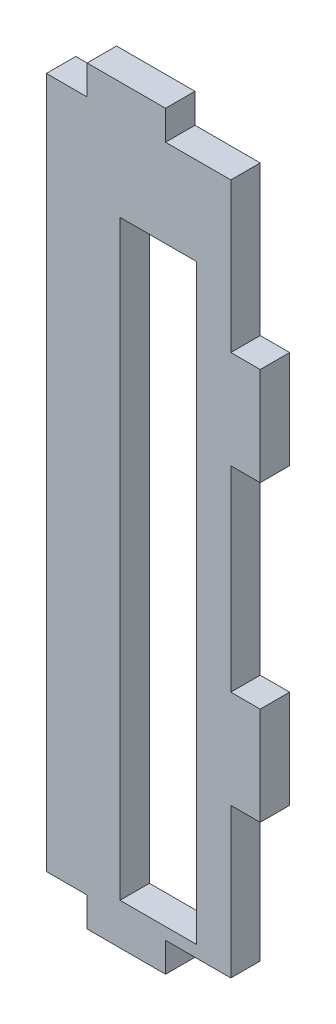
ISO-10303-21;
HEADER;
FILE_DESCRIPTION(('STEP AP214'),'2;1');
FILE_NAME('part.step','',(''),(''),'','','');
FILE_SCHEMA(('AUTOMOTIVE_DESIGN { 1 0 10303 214 1 1 1 1 }'));
ENDSEC;
DATA;
#1=APPLICATION_CONTEXT('core data for automotive mechanical design processes');
#2=APPLICATION_PROTOCOL_DEFINITION('international standard','automotive_design',2000,#1);
#3=PRODUCT_CONTEXT('',#1,'mechanical');
#4=PRODUCT('Part','Part','',(#3));
#5=PRODUCT_RELATED_PRODUCT_CATEGORY('part','',(#4));
#6=PRODUCT_DEFINITION_FORMATION('','',#4);
#7=PRODUCT_DEFINITION_CONTEXT('part definition',#1,'design');
#8=PRODUCT_DEFINITION('design','',#6,#7);
#9=PRODUCT_DEFINITION_SHAPE('','',#8);
#10=(LENGTH_UNIT() NAMED_UNIT(*) SI_UNIT(.MILLI.,.METRE.));
#11=(NAMED_UNIT(*) PLANE_ANGLE_UNIT() SI_UNIT($,.RADIAN.));
#12=(NAMED_UNIT(*) SI_UNIT($,.STERADIAN.) SOLID_ANGLE_UNIT());
#13=UNCERTAINTY_MEASURE_WITH_UNIT(LENGTH_MEASURE(1.E-05),#10,'distance_accuracy_value','');
#14=(GEOMETRIC_REPRESENTATION_CONTEXT(3) GLOBAL_UNCERTAINTY_ASSIGNED_CONTEXT((#13)) GLOBAL_UNIT_ASSIGNED_CONTEXT((#10,
#11,#12)) REPRESENTATION_CONTEXT('',''));
#15=CARTESIAN_POINT('',(0.,0.,0.));
#16=DIRECTION('',(0.,0.,1.));
#17=DIRECTION('',(1.,0.,0.));
#18=AXIS2_PLACEMENT_3D('',#15,#16,#17);
#19=CARTESIAN_POINT('',(0.,44.5,3.));
#20=DIRECTION('',(0.,-1.,0.));
#21=DIRECTION('',(0.,0.,-1.));
#22=AXIS2_PLACEMENT_3D('',#19,#20,#21);
#23=PLANE('',#22);
#24=DIRECTION('',(0.,0.,1.));
#25=VECTOR('',#24,1.);
#26=CARTESIAN_POINT('',(-14.6559207945465,44.4999999999989,0.));
#27=LINE('',#26,#25);
#28=CARTESIAN_POINT('',(-14.6559207945465,44.4999999999989,0.));
#29=VERTEX_POINT('',#28);
#30=CARTESIAN_POINT('',(-14.6559207945465,44.4999999999989,3.));
#31=VERTEX_POINT('',#30);
#32=EDGE_CURVE('E226',#29,#31,#27,.T.);
#33=ORIENTED_EDGE('',*,*,#32,.F.);
#34=DIRECTION('',(-1.,0.,0.));
#35=VECTOR('',#34,1.);
#36=CARTESIAN_POINT('',(0.,44.5,0.));
#37=LINE('',#36,#35);
#38=CARTESIAN_POINT('',(-18.811841589093,44.5,0.));
#39=VERTEX_POINT('',#38);
#40=EDGE_CURVE('E341',#29,#39,#37,.T.);
#41=ORIENTED_EDGE('',*,*,#40,.T.);
#42=DIRECTION('',(0.,0.,1.));
#43=VECTOR('',#42,1.);
#44=CARTESIAN_POINT('',(-18.811841589093,44.5,0.));
#45=LINE('',#44,#43);
#46=CARTESIAN_POINT('',(-18.811841589093,44.5,3.));
#47=VERTEX_POINT('',#46);
#48=EDGE_CURVE('E259',#39,#47,#45,.T.);
#49=ORIENTED_EDGE('',*,*,#48,.T.);
#50=DIRECTION('',(-1.,0.,0.));
#51=VECTOR('',#50,1.);
#52=CARTESIAN_POINT('',(0.,44.5,3.));
#53=LINE('',#52,#51);
#54=EDGE_CURVE('E313',#31,#47,#53,.T.);
#55=ORIENTED_EDGE('',*,*,#54,.F.);
#56=EDGE_LOOP('',(#33,#41,#49,#55));
#57=FACE_BOUND('',#56,.T.);
#58=ADVANCED_FACE('F33',(#57),#23,.F.);
#59=CARTESIAN_POINT('',(0.,-26.,3.));
#60=DIRECTION('',(0.,1.,0.));
#61=DIRECTION('',(0.,0.,1.));
#62=AXIS2_PLACEMENT_3D('',#59,#60,#61);
#63=PLANE('',#62);
#64=DIRECTION('',(0.,0.,1.));
#65=VECTOR('',#64,1.);
#66=CARTESIAN_POINT('',(-6.65592079454651,-25.9999999999989,0.));
#67=LINE('',#66,#65);
#68=CARTESIAN_POINT('',(-6.65592079454651,-25.9999999999989,0.));
#69=VERTEX_POINT('',#68);
#70=CARTESIAN_POINT('',(-6.65592079454651,-25.9999999999989,3.));
#71=VERTEX_POINT('',#70);
#72=EDGE_CURVE('E245',#69,#71,#67,.T.);
#73=ORIENTED_EDGE('',*,*,#72,.F.);
#74=DIRECTION('',(1.,0.,0.));
#75=VECTOR('',#74,1.);
#76=CARTESIAN_POINT('',(0.,-26.,0.));
#77=LINE('',#76,#75);
#78=CARTESIAN_POINT('',(0.,-26.,0.));
#79=VERTEX_POINT('',#78);
#80=EDGE_CURVE('E344',#69,#79,#77,.T.);
#81=ORIENTED_EDGE('',*,*,#80,.T.);
#82=DIRECTION('',(0.,0.,-1.));
#83=VECTOR('',#82,1.);
#84=CARTESIAN_POINT('',(0.,-26.,3.));
#85=LINE('',#84,#83);
#86=CARTESIAN_POINT('',(0.,-26.,3.));
#87=VERTEX_POINT('',#86);
#88=EDGE_CURVE('E351',#87,#79,#85,.T.);
#89=ORIENTED_EDGE('',*,*,#88,.F.);
#90=DIRECTION('',(1.,0.,0.));
#91=VECTOR('',#90,1.);
#92=CARTESIAN_POINT('',(-19.311841589093,-26.,3.));
#93=LINE('',#92,#91);
#94=EDGE_CURVE('E317',#71,#87,#93,.T.);
#95=ORIENTED_EDGE('',*,*,#94,.F.);
#96=EDGE_LOOP('',(#73,#81,#89,#95));
#97=FACE_BOUND('',#96,.T.);
#98=ADVANCED_FACE('F412',(#97),#63,.F.);
#99=CARTESIAN_POINT('',(0.,0.,3.));
#100=DIRECTION('',(0.,0.,1.));
#101=DIRECTION('',(1.,0.,0.));
#102=AXIS2_PLACEMENT_3D('',#99,#100,#101);
#103=PLANE('',#102);
#104=DIRECTION('',(0.,1.,0.));
#105=VECTOR('',#104,1.);
#106=CARTESIAN_POINT('',(-18.811841589093,-26.,3.));
#107=LINE('',#106,#105);
#108=CARTESIAN_POINT('',(-18.811841589093,-26.,3.));
#109=VERTEX_POINT('',#108);
#110=EDGE_CURVE('E247',#109,#47,#107,.T.);
#111=ORIENTED_EDGE('',*,*,#110,.F.);
#112=CARTESIAN_POINT('',(-14.6559207945465,-26.,3.));
#113=VERTEX_POINT('',#112);
#114=EDGE_CURVE('E318',#109,#113,#93,.T.);
#115=ORIENTED_EDGE('',*,*,#114,.T.);
#116=DIRECTION('',(0.,-1.,0.));
#117=VECTOR('',#116,1.);
#118=CARTESIAN_POINT('',(-14.6559207945465,-25.9999999999989,3.));
#119=LINE('',#118,#117);
#120=CARTESIAN_POINT('',(-14.6559207945465,-28.9999999999989,3.));
#121=VERTEX_POINT('',#120);
#122=EDGE_CURVE('E56',#113,#121,#119,.T.);
#123=ORIENTED_EDGE('',*,*,#122,.T.);
#124=DIRECTION('',(1.,0.,0.));
#125=VECTOR('',#124,1.);
#126=CARTESIAN_POINT('',(-6.65592079454651,-28.9999999999989,3.));
#127=LINE('',#126,#125);
#128=CARTESIAN_POINT('',(-6.65592079454651,-28.9999999999989,3.));
#129=VERTEX_POINT('',#128);
#130=EDGE_CURVE('E240',#121,#129,#127,.T.);
#131=ORIENTED_EDGE('',*,*,#130,.T.);
#132=DIRECTION('',(0.,1.,0.));
#133=VECTOR('',#132,1.);
#134=CARTESIAN_POINT('',(-6.65592079454651,-25.9999999999989,3.));
#135=LINE('',#134,#133);
#136=EDGE_CURVE('E233',#129,#71,#135,.T.);
#137=ORIENTED_EDGE('',*,*,#136,.T.);
#138=ORIENTED_EDGE('',*,*,#94,.T.);
#139=DIRECTION('',(0.,1.,0.));
#140=VECTOR('',#139,1.);
#141=CARTESIAN_POINT('',(0.,-24.,3.));
#142=LINE('',#141,#140);
#143=CARTESIAN_POINT('',(0.,-10.75,3.));
#144=VERTEX_POINT('',#143);
#145=EDGE_CURVE('E321',#87,#144,#142,.T.);
#146=ORIENTED_EDGE('',*,*,#145,.T.);
#147=DIRECTION('',(1.,0.,0.));
#148=VECTOR('',#147,1.);
#149=CARTESIAN_POINT('',(3.,-10.75,3.));
#150=LINE('',#149,#148);
#151=CARTESIAN_POINT('',(3.,-10.75,3.));
#152=VERTEX_POINT('',#151);
#153=EDGE_CURVE('E295',#144,#152,#150,.T.);
#154=ORIENTED_EDGE('',*,*,#153,.T.);
#155=DIRECTION('',(0.,1.,0.));
#156=VECTOR('',#155,1.);
#157=CARTESIAN_POINT('',(3.,-10.75,3.));
#158=LINE('',#157,#156);
#159=CARTESIAN_POINT('',(3.,-0.750000000000018,3.));
#160=VERTEX_POINT('',#159);
#161=EDGE_CURVE('E298',#152,#160,#158,.T.);
#162=ORIENTED_EDGE('',*,*,#161,.T.);
#163=DIRECTION('',(-1.,0.,0.));
#164=VECTOR('',#163,1.);
#165=CARTESIAN_POINT('',(3.,-0.750000000000018,3.));
#166=LINE('',#165,#164);
#167=CARTESIAN_POINT('',(0.,-0.750000000000015,3.));
#168=VERTEX_POINT('',#167);
#169=EDGE_CURVE('E301',#160,#168,#166,.T.);
#170=ORIENTED_EDGE('',*,*,#169,.T.);
#171=DIRECTION('',(0.,1.,0.));
#172=VECTOR('',#171,1.);
#173=CARTESIAN_POINT('',(0.,19.25,3.));
#174=LINE('',#173,#172);
#175=CARTESIAN_POINT('',(0.,19.25,3.));
#176=VERTEX_POINT('',#175);
#177=EDGE_CURVE('E303',#168,#176,#174,.T.);
#178=ORIENTED_EDGE('',*,*,#177,.T.);
#179=DIRECTION('',(1.,0.,0.));
#180=VECTOR('',#179,1.);
#181=CARTESIAN_POINT('',(3.,19.25,3.));
#182=LINE('',#181,#180);
#183=CARTESIAN_POINT('',(3.,19.25,3.));
#184=VERTEX_POINT('',#183);
#185=EDGE_CURVE('E305',#176,#184,#182,.T.);
#186=ORIENTED_EDGE('',*,*,#185,.T.);
#187=DIRECTION('',(0.,1.,0.));
#188=VECTOR('',#187,1.);
#189=CARTESIAN_POINT('',(3.,19.25,3.));
#190=LINE('',#189,#188);
#191=CARTESIAN_POINT('',(3.,29.25,3.));
#192=VERTEX_POINT('',#191);
#193=EDGE_CURVE('E307',#184,#192,#190,.T.);
#194=ORIENTED_EDGE('',*,*,#193,.T.);
#195=DIRECTION('',(-1.,0.,0.));
#196=VECTOR('',#195,1.);
#197=CARTESIAN_POINT('',(3.,29.25,3.));
#198=LINE('',#197,#196);
#199=CARTESIAN_POINT('',(0.,29.25,3.));
#200=VERTEX_POINT('',#199);
#201=EDGE_CURVE('E309',#192,#200,#198,.T.);
#202=ORIENTED_EDGE('',*,*,#201,.T.);
#203=DIRECTION('',(0.,1.,0.));
#204=VECTOR('',#203,1.);
#205=CARTESIAN_POINT('',(0.,42.4999999999999,3.));
#206=LINE('',#205,#204);
#207=CARTESIAN_POINT('',(0.,44.5,3.));
#208=VERTEX_POINT('',#207);
#209=EDGE_CURVE('E311',#200,#208,#206,.T.);
#210=ORIENTED_EDGE('',*,*,#209,.T.);
#211=CARTESIAN_POINT('',(-6.65592079454651,44.5,3.));
#212=VERTEX_POINT('',#211);
#213=EDGE_CURVE('E314',#208,#212,#53,.T.);
#214=ORIENTED_EDGE('',*,*,#213,.T.);
#215=DIRECTION('',(0.,1.,0.));
#216=VECTOR('',#215,1.);
#217=CARTESIAN_POINT('',(-6.65592079454651,44.4999999999989,3.));
#218=LINE('',#217,#216);
#219=CARTESIAN_POINT('',(-6.65592079454651,47.4999999999989,3.));
#220=VERTEX_POINT('',#219);
#221=EDGE_CURVE('E48',#212,#220,#218,.T.);
#222=ORIENTED_EDGE('',*,*,#221,.T.);
#223=DIRECTION('',(-1.,0.,0.));
#224=VECTOR('',#223,1.);
#225=CARTESIAN_POINT('',(-6.65592079454651,47.4999999999989,3.));
#226=LINE('',#225,#224);
#227=CARTESIAN_POINT('',(-14.6559207945465,47.4999999999989,3.));
#228=VERTEX_POINT('',#227);
#229=EDGE_CURVE('E199',#220,#228,#226,.T.);
#230=ORIENTED_EDGE('',*,*,#229,.T.);
#231=DIRECTION('',(0.,-1.,0.));
#232=VECTOR('',#231,1.);
#233=CARTESIAN_POINT('',(-14.6559207945465,44.4999999999989,3.));
#234=LINE('',#233,#232);
#235=EDGE_CURVE('E217',#228,#31,#234,.T.);
#236=ORIENTED_EDGE('',*,*,#235,.T.);
#237=ORIENTED_EDGE('',*,*,#54,.T.);
#238=EDGE_LOOP('',(#111,#115,#123,#131,#137,#138,#146,#154,#162,#170,#178,#186,#194,#202,#210,
#214,#222,#230,#236,#237));
#239=FACE_BOUND('',#238,.T.);
#240=DIRECTION('',(0.,1.,0.));
#241=VECTOR('',#240,1.);
#242=CARTESIAN_POINT('',(-3.49999999999997,-24.785,3.));
#243=LINE('',#242,#241);
#244=CARTESIAN_POINT('',(-3.49999999999997,-24.785,3.));
#245=VERTEX_POINT('',#244);
#246=CARTESIAN_POINT('',(-3.49999999999997,35.54,3.));
#247=VERTEX_POINT('',#246);
#248=EDGE_CURVE('E266',#245,#247,#243,.T.);
#249=ORIENTED_EDGE('',*,*,#248,.F.);
#250=DIRECTION('',(1.,0.,0.));
#251=VECTOR('',#250,1.);
#252=CARTESIAN_POINT('',(-3.49999999999997,-24.785,3.));
#253=LINE('',#252,#251);
#254=CARTESIAN_POINT('',(-11.3,-24.785,3.));
#255=VERTEX_POINT('',#254);
#256=EDGE_CURVE('E264',#255,#245,#253,.T.);
#257=ORIENTED_EDGE('',*,*,#256,.F.);
#258=DIRECTION('',(0.,-1.,0.));
#259=VECTOR('',#258,1.);
#260=CARTESIAN_POINT('',(-11.3,-24.785,3.));
#261=LINE('',#260,#259);
#262=CARTESIAN_POINT('',(-11.3,35.54,3.));
#263=VERTEX_POINT('',#262);
#264=EDGE_CURVE('E272',#263,#255,#261,.T.);
#265=ORIENTED_EDGE('',*,*,#264,.F.);
#266=DIRECTION('',(-1.,0.,0.));
#267=VECTOR('',#266,1.);
#268=CARTESIAN_POINT('',(-3.49999999999997,35.54,3.));
#269=LINE('',#268,#267);
#270=EDGE_CURVE('E269',#247,#263,#269,.T.);
#271=ORIENTED_EDGE('',*,*,#270,.F.);
#272=EDGE_LOOP('',(#249,#257,#265,#271));
#273=FACE_BOUND('',#272,.T.);
#274=ADVANCED_FACE('F394',(#239,#273),#103,.T.);
#275=CARTESIAN_POINT('',(0.,0.,0.));
#276=DIRECTION('',(0.,0.,1.));
#277=DIRECTION('',(1.,0.,0.));
#278=AXIS2_PLACEMENT_3D('',#275,#276,#277);
#279=PLANE('',#278);
#280=CARTESIAN_POINT('',(-18.811841589093,-26.,0.));
#281=VERTEX_POINT('',#280);
#282=CARTESIAN_POINT('',(-14.6559207945465,-25.9999999999989,0.));
#283=VERTEX_POINT('',#282);
#284=EDGE_CURVE('E345',#281,#283,#77,.T.);
#285=ORIENTED_EDGE('',*,*,#284,.F.);
#286=DIRECTION('',(0.,1.,0.));
#287=VECTOR('',#286,1.);
#288=CARTESIAN_POINT('',(-18.811841589093,-26.,0.));
#289=LINE('',#288,#287);
#290=EDGE_CURVE('E253',#281,#39,#289,.T.);
#291=ORIENTED_EDGE('',*,*,#290,.T.);
#292=ORIENTED_EDGE('',*,*,#40,.F.);
#293=DIRECTION('',(0.,-1.,0.));
#294=VECTOR('',#293,1.);
#295=CARTESIAN_POINT('',(-14.6559207945465,44.4999999999989,0.));
#296=LINE('',#295,#294);
#297=CARTESIAN_POINT('',(-14.6559207945465,47.4999999999989,0.));
#298=VERTEX_POINT('',#297);
#299=EDGE_CURVE('E202',#298,#29,#296,.T.);
#300=ORIENTED_EDGE('',*,*,#299,.F.);
#301=DIRECTION('',(-1.,0.,0.));
#302=VECTOR('',#301,1.);
#303=CARTESIAN_POINT('',(-6.65592079454651,47.4999999999989,0.));
#304=LINE('',#303,#302);
#305=CARTESIAN_POINT('',(-6.65592079454651,47.4999999999989,0.));
#306=VERTEX_POINT('',#305);
#307=EDGE_CURVE('E197',#306,#298,#304,.T.);
#308=ORIENTED_EDGE('',*,*,#307,.F.);
#309=DIRECTION('',(0.,1.,0.));
#310=VECTOR('',#309,1.);
#311=CARTESIAN_POINT('',(-6.65592079454651,44.4999999999989,0.));
#312=LINE('',#311,#310);
#313=CARTESIAN_POINT('',(-6.65592079454651,44.4999999999989,0.));
#314=VERTEX_POINT('',#313);
#315=EDGE_CURVE('E211',#314,#306,#312,.T.);
#316=ORIENTED_EDGE('',*,*,#315,.F.);
#317=CARTESIAN_POINT('',(0.,44.5,0.));
#318=VERTEX_POINT('',#317);
#319=EDGE_CURVE('E342',#318,#314,#37,.T.);
#320=ORIENTED_EDGE('',*,*,#319,.F.);
#321=DIRECTION('',(0.,1.,0.));
#322=VECTOR('',#321,1.);
#323=CARTESIAN_POINT('',(0.,44.5,0.));
#324=LINE('',#323,#322);
#325=CARTESIAN_POINT('',(0.,29.25,0.));
#326=VERTEX_POINT('',#325);
#327=EDGE_CURVE('E339',#326,#318,#324,.T.);
#328=ORIENTED_EDGE('',*,*,#327,.F.);
#329=DIRECTION('',(-1.,0.,0.));
#330=VECTOR('',#329,1.);
#331=CARTESIAN_POINT('',(3.,29.25,0.));
#332=LINE('',#331,#330);
#333=CARTESIAN_POINT('',(3.,29.25,0.));
#334=VERTEX_POINT('',#333);
#335=EDGE_CURVE('E336',#334,#326,#332,.T.);
#336=ORIENTED_EDGE('',*,*,#335,.F.);
#337=DIRECTION('',(0.,1.,0.));
#338=VECTOR('',#337,1.);
#339=CARTESIAN_POINT('',(3.,19.25,0.));
#340=LINE('',#339,#338);
#341=CARTESIAN_POINT('',(3.,19.25,0.));
#342=VERTEX_POINT('',#341);
#343=EDGE_CURVE('E334',#342,#334,#340,.T.);
#344=ORIENTED_EDGE('',*,*,#343,.F.);
#345=DIRECTION('',(1.,0.,0.));
#346=VECTOR('',#345,1.);
#347=CARTESIAN_POINT('',(3.,19.25,0.));
#348=LINE('',#347,#346);
#349=CARTESIAN_POINT('',(0.,19.25,0.));
#350=VERTEX_POINT('',#349);
#351=EDGE_CURVE('E332',#350,#342,#348,.T.);
#352=ORIENTED_EDGE('',*,*,#351,.F.);
#353=DIRECTION('',(0.,1.,0.));
#354=VECTOR('',#353,1.);
#355=CARTESIAN_POINT('',(0.,19.25,0.));
#356=LINE('',#355,#354);
#357=CARTESIAN_POINT('',(0.,-0.750000000000015,0.));
#358=VERTEX_POINT('',#357);
#359=EDGE_CURVE('E330',#358,#350,#356,.T.);
#360=ORIENTED_EDGE('',*,*,#359,.F.);
#361=DIRECTION('',(-1.,0.,0.));
#362=VECTOR('',#361,1.);
#363=CARTESIAN_POINT('',(3.,-0.750000000000018,0.));
#364=LINE('',#363,#362);
#365=CARTESIAN_POINT('',(3.,-0.750000000000018,0.));
#366=VERTEX_POINT('',#365);
#367=EDGE_CURVE('E328',#366,#358,#364,.T.);
#368=ORIENTED_EDGE('',*,*,#367,.F.);
#369=DIRECTION('',(0.,1.,0.));
#370=VECTOR('',#369,1.);
#371=CARTESIAN_POINT('',(3.,-10.75,0.));
#372=LINE('',#371,#370);
#373=CARTESIAN_POINT('',(3.,-10.75,0.));
#374=VERTEX_POINT('',#373);
#375=EDGE_CURVE('E326',#374,#366,#372,.T.);
#376=ORIENTED_EDGE('',*,*,#375,.F.);
#377=DIRECTION('',(1.,0.,0.));
#378=VECTOR('',#377,1.);
#379=CARTESIAN_POINT('',(3.,-10.75,0.));
#380=LINE('',#379,#378);
#381=CARTESIAN_POINT('',(0.,-10.75,0.));
#382=VERTEX_POINT('',#381);
#383=EDGE_CURVE('E294',#382,#374,#380,.T.);
#384=ORIENTED_EDGE('',*,*,#383,.F.);
#385=DIRECTION('',(0.,1.,0.));
#386=VECTOR('',#385,1.);
#387=CARTESIAN_POINT('',(0.,-10.75,0.));
#388=LINE('',#387,#386);
#389=EDGE_CURVE('E299',#79,#382,#388,.T.);
#390=ORIENTED_EDGE('',*,*,#389,.F.);
#391=ORIENTED_EDGE('',*,*,#80,.F.);
#392=DIRECTION('',(0.,1.,0.));
#393=VECTOR('',#392,1.);
#394=CARTESIAN_POINT('',(-6.65592079454651,-25.9999999999989,0.));
#395=LINE('',#394,#393);
#396=CARTESIAN_POINT('',(-6.65592079454651,-28.9999999999989,0.));
#397=VERTEX_POINT('',#396);
#398=EDGE_CURVE('E236',#397,#69,#395,.T.);
#399=ORIENTED_EDGE('',*,*,#398,.F.);
#400=DIRECTION('',(1.,0.,0.));
#401=VECTOR('',#400,1.);
#402=CARTESIAN_POINT('',(-6.65592079454651,-28.9999999999989,0.));
#403=LINE('',#402,#401);
#404=CARTESIAN_POINT('',(-14.6559207945465,-28.9999999999989,0.));
#405=VERTEX_POINT('',#404);
#406=EDGE_CURVE('E232',#405,#397,#403,.T.);
#407=ORIENTED_EDGE('',*,*,#406,.F.);
#408=DIRECTION('',(0.,-1.,0.));
#409=VECTOR('',#408,1.);
#410=CARTESIAN_POINT('',(-14.6559207945465,-25.9999999999989,0.));
#411=LINE('',#410,#409);
#412=EDGE_CURVE('E229',#283,#405,#411,.T.);
#413=ORIENTED_EDGE('',*,*,#412,.F.);
#414=EDGE_LOOP('',(#285,#291,#292,#300,#308,#316,#320,#328,#336,#344,#352,#360,#368,#376,#384,
#390,#391,#399,#407,#413));
#415=FACE_BOUND('',#414,.T.);
#416=DIRECTION('',(1.,0.,0.));
#417=VECTOR('',#416,1.);
#418=CARTESIAN_POINT('',(-3.49999999999997,-24.785,0.));
#419=LINE('',#418,#417);
#420=CARTESIAN_POINT('',(-11.3,-24.785,0.));
#421=VERTEX_POINT('',#420);
#422=CARTESIAN_POINT('',(-3.49999999999997,-24.785,0.));
#423=VERTEX_POINT('',#422);
#424=EDGE_CURVE('E262',#421,#423,#419,.T.);
#425=ORIENTED_EDGE('',*,*,#424,.T.);
#426=DIRECTION('',(0.,1.,0.));
#427=VECTOR('',#426,1.);
#428=CARTESIAN_POINT('',(-3.49999999999997,-24.785,0.));
#429=LINE('',#428,#427);
#430=CARTESIAN_POINT('',(-3.49999999999997,35.54,0.));
#431=VERTEX_POINT('',#430);
#432=EDGE_CURVE('E277',#423,#431,#429,.T.);
#433=ORIENTED_EDGE('',*,*,#432,.T.);
#434=DIRECTION('',(-1.,0.,0.));
#435=VECTOR('',#434,1.);
#436=CARTESIAN_POINT('',(-3.49999999999997,35.54,0.));
#437=LINE('',#436,#435);
#438=CARTESIAN_POINT('',(-11.3,35.54,0.));
#439=VERTEX_POINT('',#438);
#440=EDGE_CURVE('E280',#431,#439,#437,.T.);
#441=ORIENTED_EDGE('',*,*,#440,.T.);
#442=DIRECTION('',(0.,-1.,0.));
#443=VECTOR('',#442,1.);
#444=CARTESIAN_POINT('',(-11.3,-24.785,0.));
#445=LINE('',#444,#443);
#446=EDGE_CURVE('E267',#439,#421,#445,.T.);
#447=ORIENTED_EDGE('',*,*,#446,.T.);
#448=EDGE_LOOP('',(#425,#433,#441,#447));
#449=FACE_BOUND('',#448,.T.);
#450=ADVANCED_FACE('F208',(#415,#449),#279,.F.);
#451=CARTESIAN_POINT('',(3.,-10.75,3.));
#452=DIRECTION('',(0.,1.,0.));
#453=DIRECTION('',(0.,0.,1.));
#454=AXIS2_PLACEMENT_3D('',#451,#452,#453);
#455=PLANE('',#454);
#456=ORIENTED_EDGE('',*,*,#383,.T.);
#457=DIRECTION('',(0.,0.,-1.));
#458=VECTOR('',#457,1.);
#459=CARTESIAN_POINT('',(3.,-10.75,3.));
#460=LINE('',#459,#458);
#461=EDGE_CURVE('E11',#152,#374,#460,.T.);
#462=ORIENTED_EDGE('',*,*,#461,.F.);
#463=ORIENTED_EDGE('',*,*,#153,.F.);
#464=DIRECTION('',(0.,0.,-1.));
#465=VECTOR('',#464,1.);
#466=CARTESIAN_POINT('',(0.,-10.75,3.));
#467=LINE('',#466,#465);
#468=EDGE_CURVE('E323',#144,#382,#467,.T.);
#469=ORIENTED_EDGE('',*,*,#468,.T.);
#470=EDGE_LOOP('',(#456,#462,#463,#469));
#471=FACE_BOUND('',#470,.T.);
#472=ADVANCED_FACE('F35',(#471),#455,.F.);
#473=CARTESIAN_POINT('',(3.,-10.75,3.));
#474=DIRECTION('',(-1.,0.,0.));
#475=DIRECTION('',(0.,0.,1.));
#476=AXIS2_PLACEMENT_3D('',#473,#474,#475);
#477=PLANE('',#476);
#478=ORIENTED_EDGE('',*,*,#375,.T.);
#479=DIRECTION('',(0.,0.,-1.));
#480=VECTOR('',#479,1.);
#481=CARTESIAN_POINT('',(3.,-0.750000000000018,3.));
#482=LINE('',#481,#480);
#483=EDGE_CURVE('E41',#160,#366,#482,.T.);
#484=ORIENTED_EDGE('',*,*,#483,.F.);
#485=ORIENTED_EDGE('',*,*,#161,.F.);
#486=ORIENTED_EDGE('',*,*,#461,.T.);
#487=EDGE_LOOP('',(#478,#484,#485,#486));
#488=FACE_BOUND('',#487,.T.);
#489=ADVANCED_FACE('F399',(#488),#477,.F.);
#490=CARTESIAN_POINT('',(3.,-0.750000000000018,3.));
#491=DIRECTION('',(0.,-1.,0.));
#492=DIRECTION('',(1.,0.,0.));
#493=AXIS2_PLACEMENT_3D('',#490,#491,#492);
#494=PLANE('',#493);
#495=ORIENTED_EDGE('',*,*,#367,.T.);
#496=DIRECTION('',(0.,0.,-1.));
#497=VECTOR('',#496,1.);
#498=CARTESIAN_POINT('',(0.,-0.750000000000015,3.));
#499=LINE('',#498,#497);
#500=EDGE_CURVE('E369',#168,#358,#499,.T.);
#501=ORIENTED_EDGE('',*,*,#500,.F.);
#502=ORIENTED_EDGE('',*,*,#169,.F.);
#503=ORIENTED_EDGE('',*,*,#483,.T.);
#504=EDGE_LOOP('',(#495,#501,#502,#503));
#505=FACE_BOUND('',#504,.T.);
#506=ADVANCED_FACE('F376',(#505),#494,.F.);
#507=CARTESIAN_POINT('',(0.,19.25,3.));
#508=DIRECTION('',(-1.,0.,0.));
#509=DIRECTION('',(0.,0.,1.));
#510=AXIS2_PLACEMENT_3D('',#507,#508,#509);
#511=PLANE('',#510);
#512=ORIENTED_EDGE('',*,*,#359,.T.);
#513=DIRECTION('',(0.,0.,-1.));
#514=VECTOR('',#513,1.);
#515=CARTESIAN_POINT('',(0.,19.25,3.));
#516=LINE('',#515,#514);
#517=EDGE_CURVE('E366',#176,#350,#516,.T.);
#518=ORIENTED_EDGE('',*,*,#517,.F.);
#519=ORIENTED_EDGE('',*,*,#177,.F.);
#520=ORIENTED_EDGE('',*,*,#500,.T.);
#521=EDGE_LOOP('',(#512,#518,#519,#520));
#522=FACE_BOUND('',#521,.T.);
#523=ADVANCED_FACE('F385',(#522),#511,.F.);
#524=CARTESIAN_POINT('',(3.,19.25,3.));
#525=DIRECTION('',(0.,1.,0.));
#526=DIRECTION('',(0.,0.,1.));
#527=AXIS2_PLACEMENT_3D('',#524,#525,#526);
#528=PLANE('',#527);
#529=ORIENTED_EDGE('',*,*,#351,.T.);
#530=DIRECTION('',(0.,0.,-1.));
#531=VECTOR('',#530,1.);
#532=CARTESIAN_POINT('',(3.,19.25,3.));
#533=LINE('',#532,#531);
#534=EDGE_CURVE('E363',#184,#342,#533,.T.);
#535=ORIENTED_EDGE('',*,*,#534,.F.);
#536=ORIENTED_EDGE('',*,*,#185,.F.);
#537=ORIENTED_EDGE('',*,*,#517,.T.);
#538=EDGE_LOOP('',(#529,#535,#536,#537));
#539=FACE_BOUND('',#538,.T.);
#540=ADVANCED_FACE('F389',(#539),#528,.F.);
#541=CARTESIAN_POINT('',(3.,19.25,3.));
#542=DIRECTION('',(-1.,0.,0.));
#543=DIRECTION('',(0.,0.,1.));
#544=AXIS2_PLACEMENT_3D('',#541,#542,#543);
#545=PLANE('',#544);
#546=ORIENTED_EDGE('',*,*,#343,.T.);
#547=DIRECTION('',(0.,0.,-1.));
#548=VECTOR('',#547,1.);
#549=CARTESIAN_POINT('',(3.,29.25,3.));
#550=LINE('',#549,#548);
#551=EDGE_CURVE('E360',#192,#334,#550,.T.);
#552=ORIENTED_EDGE('',*,*,#551,.F.);
#553=ORIENTED_EDGE('',*,*,#193,.F.);
#554=ORIENTED_EDGE('',*,*,#534,.T.);
#555=EDGE_LOOP('',(#546,#552,#553,#554));
#556=FACE_BOUND('',#555,.T.);
#557=ADVANCED_FACE('F455',(#556),#545,.F.);
#558=CARTESIAN_POINT('',(3.,29.25,3.));
#559=DIRECTION('',(0.,-1.,0.));
#560=DIRECTION('',(0.,0.,-1.));
#561=AXIS2_PLACEMENT_3D('',#558,#559,#560);
#562=PLANE('',#561);
#563=ORIENTED_EDGE('',*,*,#335,.T.);
#564=DIRECTION('',(0.,0.,-1.));
#565=VECTOR('',#564,1.);
#566=CARTESIAN_POINT('',(0.,29.25,3.));
#567=LINE('',#566,#565);
#568=EDGE_CURVE('E357',#200,#326,#567,.T.);
#569=ORIENTED_EDGE('',*,*,#568,.F.);
#570=ORIENTED_EDGE('',*,*,#201,.F.);
#571=ORIENTED_EDGE('',*,*,#551,.T.);
#572=EDGE_LOOP('',(#563,#569,#570,#571));
#573=FACE_BOUND('',#572,.T.);
#574=ADVANCED_FACE('F444',(#573),#562,.F.);
#575=CARTESIAN_POINT('',(0.,44.5,3.));
#576=DIRECTION('',(-1.,0.,0.));
#577=DIRECTION('',(0.,0.,1.));
#578=AXIS2_PLACEMENT_3D('',#575,#576,#577);
#579=PLANE('',#578);
#580=ORIENTED_EDGE('',*,*,#327,.T.);
#581=DIRECTION('',(0.,0.,-1.));
#582=VECTOR('',#581,1.);
#583=CARTESIAN_POINT('',(0.,44.5,3.));
#584=LINE('',#583,#582);
#585=EDGE_CURVE('E354',#208,#318,#584,.T.);
#586=ORIENTED_EDGE('',*,*,#585,.F.);
#587=ORIENTED_EDGE('',*,*,#209,.F.);
#588=ORIENTED_EDGE('',*,*,#568,.T.);
#589=EDGE_LOOP('',(#580,#586,#587,#588));
#590=FACE_BOUND('',#589,.T.);
#591=ADVANCED_FACE('F446',(#590),#579,.F.);
#592=ORIENTED_EDGE('',*,*,#319,.T.);
#593=DIRECTION('',(0.,0.,1.));
#594=VECTOR('',#593,1.);
#595=CARTESIAN_POINT('',(-6.65592079454651,44.4999999999989,0.));
#596=LINE('',#595,#594);
#597=EDGE_CURVE('E216',#314,#212,#596,.T.);
#598=ORIENTED_EDGE('',*,*,#597,.T.);
#599=ORIENTED_EDGE('',*,*,#213,.F.);
#600=ORIENTED_EDGE('',*,*,#585,.T.);
#601=EDGE_LOOP('',(#592,#598,#599,#600));
#602=FACE_BOUND('',#601,.T.);
#603=ADVANCED_FACE('F439',(#602),#23,.F.);
#604=ORIENTED_EDGE('',*,*,#284,.T.);
#605=DIRECTION('',(0.,0.,1.));
#606=VECTOR('',#605,1.);
#607=CARTESIAN_POINT('',(-14.6559207945465,-25.9999999999989,0.));
#608=LINE('',#607,#606);
#609=EDGE_CURVE('E238',#283,#113,#608,.T.);
#610=ORIENTED_EDGE('',*,*,#609,.T.);
#611=ORIENTED_EDGE('',*,*,#114,.F.);
#612=DIRECTION('',(0.,0.,1.));
#613=VECTOR('',#612,1.);
#614=CARTESIAN_POINT('',(-18.811841589093,-26.,0.));
#615=LINE('',#614,#613);
#616=EDGE_CURVE('E256',#281,#109,#615,.T.);
#617=ORIENTED_EDGE('',*,*,#616,.F.);
#618=EDGE_LOOP('',(#604,#610,#611,#617));
#619=FACE_BOUND('',#618,.T.);
#620=ADVANCED_FACE('F424',(#619),#63,.F.);
#621=CARTESIAN_POINT('',(0.,-10.75,3.));
#622=DIRECTION('',(-1.,0.,0.));
#623=DIRECTION('',(0.,0.,1.));
#624=AXIS2_PLACEMENT_3D('',#621,#622,#623);
#625=PLANE('',#624);
#626=ORIENTED_EDGE('',*,*,#389,.T.);
#627=ORIENTED_EDGE('',*,*,#468,.F.);
#628=ORIENTED_EDGE('',*,*,#145,.F.);
#629=ORIENTED_EDGE('',*,*,#88,.T.);
#630=EDGE_LOOP('',(#626,#627,#628,#629));
#631=FACE_BOUND('',#630,.T.);
#632=ADVANCED_FACE('F408',(#631),#625,.F.);
#633=CARTESIAN_POINT('',(-3.49999999999997,-24.785,3.));
#634=DIRECTION('',(0.,1.,0.));
#635=DIRECTION('',(0.,0.,1.));
#636=AXIS2_PLACEMENT_3D('',#633,#634,#635);
#637=PLANE('',#636);
#638=ORIENTED_EDGE('',*,*,#424,.F.);
#639=DIRECTION('',(0.,0.,-1.));
#640=VECTOR('',#639,1.);
#641=CARTESIAN_POINT('',(-11.3,-24.785,3.));
#642=LINE('',#641,#640);
#643=EDGE_CURVE('E274',#255,#421,#642,.T.);
#644=ORIENTED_EDGE('',*,*,#643,.F.);
#645=ORIENTED_EDGE('',*,*,#256,.T.);
#646=DIRECTION('',(0.,0.,-1.));
#647=VECTOR('',#646,1.);
#648=CARTESIAN_POINT('',(-3.49999999999997,-24.785,3.));
#649=LINE('',#648,#647);
#650=EDGE_CURVE('E291',#245,#423,#649,.T.);
#651=ORIENTED_EDGE('',*,*,#650,.T.);
#652=EDGE_LOOP('',(#638,#644,#645,#651));
#653=FACE_BOUND('',#652,.T.);
#654=ADVANCED_FACE('F467',(#653),#637,.T.);
#655=CARTESIAN_POINT('',(-3.49999999999997,-24.785,3.));
#656=DIRECTION('',(-1.,0.,0.));
#657=DIRECTION('',(0.,0.,1.));
#658=AXIS2_PLACEMENT_3D('',#655,#656,#657);
#659=PLANE('',#658);
#660=ORIENTED_EDGE('',*,*,#432,.F.);
#661=ORIENTED_EDGE('',*,*,#650,.F.);
#662=ORIENTED_EDGE('',*,*,#248,.T.);
#663=DIRECTION('',(0.,0.,-1.));
#664=VECTOR('',#663,1.);
#665=CARTESIAN_POINT('',(-3.49999999999997,35.54,3.));
#666=LINE('',#665,#664);
#667=EDGE_CURVE('E289',#247,#431,#666,.T.);
#668=ORIENTED_EDGE('',*,*,#667,.T.);
#669=EDGE_LOOP('',(#660,#661,#662,#668));
#670=FACE_BOUND('',#669,.T.);
#671=ADVANCED_FACE('F474',(#670),#659,.T.);
#672=CARTESIAN_POINT('',(-3.49999999999997,35.54,3.));
#673=DIRECTION('',(0.,-1.,0.));
#674=DIRECTION('',(0.,0.,-1.));
#675=AXIS2_PLACEMENT_3D('',#672,#673,#674);
#676=PLANE('',#675);
#677=ORIENTED_EDGE('',*,*,#440,.F.);
#678=ORIENTED_EDGE('',*,*,#667,.F.);
#679=ORIENTED_EDGE('',*,*,#270,.T.);
#680=DIRECTION('',(0.,0.,-1.));
#681=VECTOR('',#680,1.);
#682=CARTESIAN_POINT('',(-11.3,35.54,3.));
#683=LINE('',#682,#681);
#684=EDGE_CURVE('E287',#263,#439,#683,.T.);
#685=ORIENTED_EDGE('',*,*,#684,.T.);
#686=EDGE_LOOP('',(#677,#678,#679,#685));
#687=FACE_BOUND('',#686,.T.);
#688=ADVANCED_FACE('F478',(#687),#676,.T.);
#689=CARTESIAN_POINT('',(-11.3,-24.785,3.));
#690=DIRECTION('',(1.,0.,0.));
#691=DIRECTION('',(0.,0.,-1.));
#692=AXIS2_PLACEMENT_3D('',#689,#690,#691);
#693=PLANE('',#692);
#694=ORIENTED_EDGE('',*,*,#446,.F.);
#695=ORIENTED_EDGE('',*,*,#684,.F.);
#696=ORIENTED_EDGE('',*,*,#264,.T.);
#697=ORIENTED_EDGE('',*,*,#643,.T.);
#698=EDGE_LOOP('',(#694,#695,#696,#697));
#699=FACE_BOUND('',#698,.T.);
#700=ADVANCED_FACE('F482',(#699),#693,.T.);
#701=CARTESIAN_POINT('',(-18.811841589093,-26.,0.));
#702=DIRECTION('',(1.,0.,0.));
#703=DIRECTION('',(0.,0.,-1.));
#704=AXIS2_PLACEMENT_3D('',#701,#702,#703);
#705=PLANE('',#704);
#706=ORIENTED_EDGE('',*,*,#110,.T.);
#707=ORIENTED_EDGE('',*,*,#48,.F.);
#708=ORIENTED_EDGE('',*,*,#290,.F.);
#709=ORIENTED_EDGE('',*,*,#616,.T.);
#710=EDGE_LOOP('',(#706,#707,#708,#709));
#711=FACE_BOUND('',#710,.T.);
#712=ADVANCED_FACE('F429',(#711),#705,.F.);
#713=CARTESIAN_POINT('',(-6.65592079454651,-25.9999999999989,0.));
#714=DIRECTION('',(1.,0.,0.));
#715=DIRECTION('',(0.,0.,-1.));
#716=AXIS2_PLACEMENT_3D('',#713,#714,#715);
#717=PLANE('',#716);
#718=ORIENTED_EDGE('',*,*,#136,.F.);
#719=DIRECTION('',(0.,0.,1.));
#720=VECTOR('',#719,1.);
#721=CARTESIAN_POINT('',(-6.65592079454651,-28.9999999999989,0.));
#722=LINE('',#721,#720);
#723=EDGE_CURVE('E248',#397,#129,#722,.T.);
#724=ORIENTED_EDGE('',*,*,#723,.F.);
#725=ORIENTED_EDGE('',*,*,#398,.T.);
#726=ORIENTED_EDGE('',*,*,#72,.T.);
#727=EDGE_LOOP('',(#718,#724,#725,#726));
#728=FACE_BOUND('',#727,.T.);
#729=ADVANCED_FACE('F415',(#728),#717,.T.);
#730=CARTESIAN_POINT('',(-6.65592079454651,-28.9999999999989,0.));
#731=DIRECTION('',(0.,-1.,0.));
#732=DIRECTION('',(0.,0.,-1.));
#733=AXIS2_PLACEMENT_3D('',#730,#731,#732);
#734=PLANE('',#733);
#735=ORIENTED_EDGE('',*,*,#130,.F.);
#736=DIRECTION('',(0.,0.,1.));
#737=VECTOR('',#736,1.);
#738=CARTESIAN_POINT('',(-14.6559207945465,-28.9999999999989,0.));
#739=LINE('',#738,#737);
#740=EDGE_CURVE('E250',#405,#121,#739,.T.);
#741=ORIENTED_EDGE('',*,*,#740,.F.);
#742=ORIENTED_EDGE('',*,*,#406,.T.);
#743=ORIENTED_EDGE('',*,*,#723,.T.);
#744=EDGE_LOOP('',(#735,#741,#742,#743));
#745=FACE_BOUND('',#744,.T.);
#746=ADVANCED_FACE('F418',(#745),#734,.T.);
#747=CARTESIAN_POINT('',(-14.6559207945465,-25.9999999999989,0.));
#748=DIRECTION('',(-1.,0.,0.));
#749=DIRECTION('',(0.,0.,1.));
#750=AXIS2_PLACEMENT_3D('',#747,#748,#749);
#751=PLANE('',#750);
#752=ORIENTED_EDGE('',*,*,#122,.F.);
#753=ORIENTED_EDGE('',*,*,#609,.F.);
#754=ORIENTED_EDGE('',*,*,#412,.T.);
#755=ORIENTED_EDGE('',*,*,#740,.T.);
#756=EDGE_LOOP('',(#752,#753,#754,#755));
#757=FACE_BOUND('',#756,.T.);
#758=ADVANCED_FACE('F421',(#757),#751,.T.);
#759=CARTESIAN_POINT('',(-6.65592079454651,44.4999999999989,0.));
#760=DIRECTION('',(1.,0.,0.));
#761=DIRECTION('',(0.,0.,-1.));
#762=AXIS2_PLACEMENT_3D('',#759,#760,#761);
#763=PLANE('',#762);
#764=ORIENTED_EDGE('',*,*,#221,.F.);
#765=ORIENTED_EDGE('',*,*,#597,.F.);
#766=ORIENTED_EDGE('',*,*,#315,.T.);
#767=DIRECTION('',(0.,0.,1.));
#768=VECTOR('',#767,1.);
#769=CARTESIAN_POINT('',(-6.65592079454651,47.4999999999989,0.));
#770=LINE('',#769,#768);
#771=EDGE_CURVE('E194',#306,#220,#770,.T.);
#772=ORIENTED_EDGE('',*,*,#771,.T.);
#773=EDGE_LOOP('',(#764,#765,#766,#772));
#774=FACE_BOUND('',#773,.T.);
#775=ADVANCED_FACE('F215',(#774),#763,.T.);
#776=CARTESIAN_POINT('',(-14.6559207945465,44.4999999999989,0.));
#777=DIRECTION('',(-1.,0.,0.));
#778=DIRECTION('',(0.,0.,1.));
#779=AXIS2_PLACEMENT_3D('',#776,#777,#778);
#780=PLANE('',#779);
#781=ORIENTED_EDGE('',*,*,#235,.F.);
#782=DIRECTION('',(0.,0.,1.));
#783=VECTOR('',#782,1.);
#784=CARTESIAN_POINT('',(-14.6559207945465,47.4999999999989,0.));
#785=LINE('',#784,#783);
#786=EDGE_CURVE('E201',#298,#228,#785,.T.);
#787=ORIENTED_EDGE('',*,*,#786,.F.);
#788=ORIENTED_EDGE('',*,*,#299,.T.);
#789=ORIENTED_EDGE('',*,*,#32,.T.);
#790=EDGE_LOOP('',(#781,#787,#788,#789));
#791=FACE_BOUND('',#790,.T.);
#792=ADVANCED_FACE('F434',(#791),#780,.T.);
#793=CARTESIAN_POINT('',(-6.65592079454651,47.4999999999989,0.));
#794=DIRECTION('',(0.,1.,0.));
#795=DIRECTION('',(0.,0.,1.));
#796=AXIS2_PLACEMENT_3D('',#793,#794,#795);
#797=PLANE('',#796);
#798=ORIENTED_EDGE('',*,*,#229,.F.);
#799=ORIENTED_EDGE('',*,*,#771,.F.);
#800=ORIENTED_EDGE('',*,*,#307,.T.);
#801=ORIENTED_EDGE('',*,*,#786,.T.);
#802=EDGE_LOOP('',(#798,#799,#800,#801));
#803=FACE_BOUND('',#802,.T.);
#804=ADVANCED_FACE('F196',(#803),#797,.T.);
#805=CLOSED_SHELL('',(#58,#98,#274,#450,#472,#489,#506,#523,#540,#557,#574,#591,#603,#620,#632,
#654,#671,#688,#700,#712,#729,#746,#758,#775,#792,#804));
#806=MANIFOLD_SOLID_BREP('B2',#805);
#807=ADVANCED_BREP_SHAPE_REPRESENTATION('',(#18,#806),#14);
#808=SHAPE_DEFINITION_REPRESENTATION(#9,#807);
ENDSEC;
END-ISO-10303-21;
